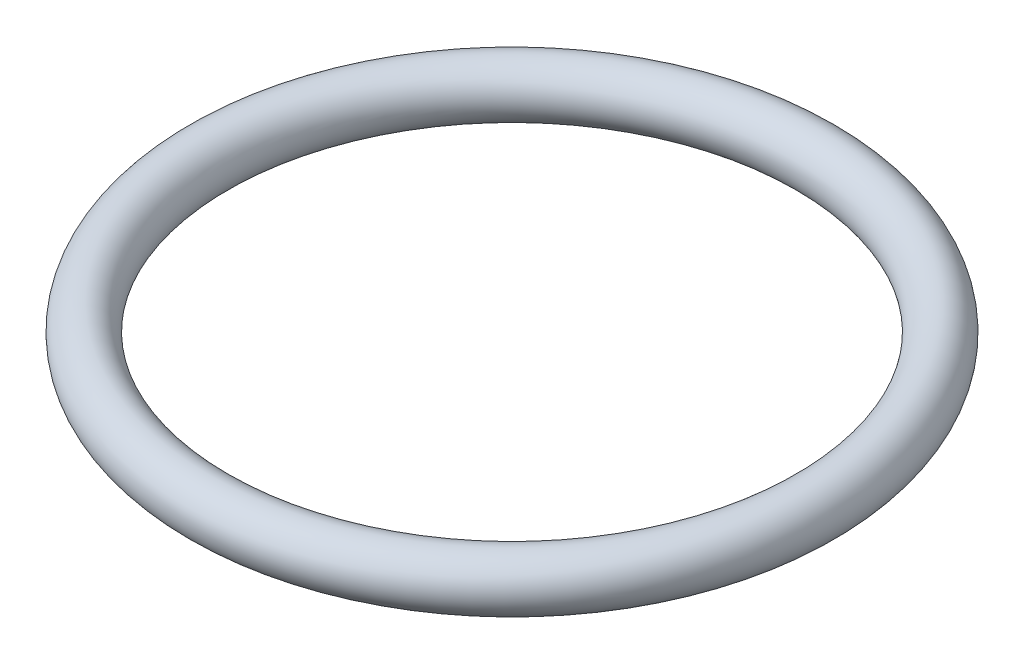
ISO-10303-21;
HEADER;
FILE_DESCRIPTION(('STEP AP214'),'2;1');
FILE_NAME('part.step','',(''),(''),'','','');
FILE_SCHEMA(('AUTOMOTIVE_DESIGN { 1 0 10303 214 1 1 1 1 }'));
ENDSEC;
DATA;
#1=APPLICATION_CONTEXT('core data for automotive mechanical design processes');
#2=APPLICATION_PROTOCOL_DEFINITION('international standard','automotive_design',2000,#1);
#3=PRODUCT_CONTEXT('',#1,'mechanical');
#4=PRODUCT('Part','Part','',(#3));
#5=PRODUCT_RELATED_PRODUCT_CATEGORY('part','',(#4));
#6=PRODUCT_DEFINITION_FORMATION('','',#4);
#7=PRODUCT_DEFINITION_CONTEXT('part definition',#1,'design');
#8=PRODUCT_DEFINITION('design','',#6,#7);
#9=PRODUCT_DEFINITION_SHAPE('','',#8);
#10=(LENGTH_UNIT() NAMED_UNIT(*) SI_UNIT(.MILLI.,.METRE.));
#11=(NAMED_UNIT(*) PLANE_ANGLE_UNIT() SI_UNIT($,.RADIAN.));
#12=(NAMED_UNIT(*) SI_UNIT($,.STERADIAN.) SOLID_ANGLE_UNIT());
#13=UNCERTAINTY_MEASURE_WITH_UNIT(LENGTH_MEASURE(1.E-05),#10,'distance_accuracy_value','');
#14=(GEOMETRIC_REPRESENTATION_CONTEXT(3) GLOBAL_UNCERTAINTY_ASSIGNED_CONTEXT((#13)) GLOBAL_UNIT_ASSIGNED_CONTEXT((#10,
#11,#12)) REPRESENTATION_CONTEXT('',''));
#15=CARTESIAN_POINT('',(0.,0.,0.));
#16=DIRECTION('',(0.,0.,1.));
#17=DIRECTION('',(1.,0.,0.));
#18=AXIS2_PLACEMENT_3D('',#15,#16,#17);
#19=CARTESIAN_POINT('',(0.,0.,0.));
#20=DIRECTION('',(0.,1.,0.));
#21=DIRECTION('',(0.,0.,1.));
#22=AXIS2_PLACEMENT_3D('',#19,#20,#21);
#23=TOROIDAL_SURFACE('',#22,17.,1.5);
#24=CARTESIAN_POINT('',(0.,0.,18.5));
#25=VERTEX_POINT('',#24);
#26=VERTEX_LOOP('',#25);
#27=FACE_BOUND('',#26,.T.);
#28=ADVANCED_FACE('F33',(#27),#23,.T.);
#29=CLOSED_SHELL('',(#28));
#30=MANIFOLD_SOLID_BREP('B2',#29);
#31=ADVANCED_BREP_SHAPE_REPRESENTATION('',(#18,#30),#14);
#32=SHAPE_DEFINITION_REPRESENTATION(#9,#31);
ENDSEC;
END-ISO-10303-21;
